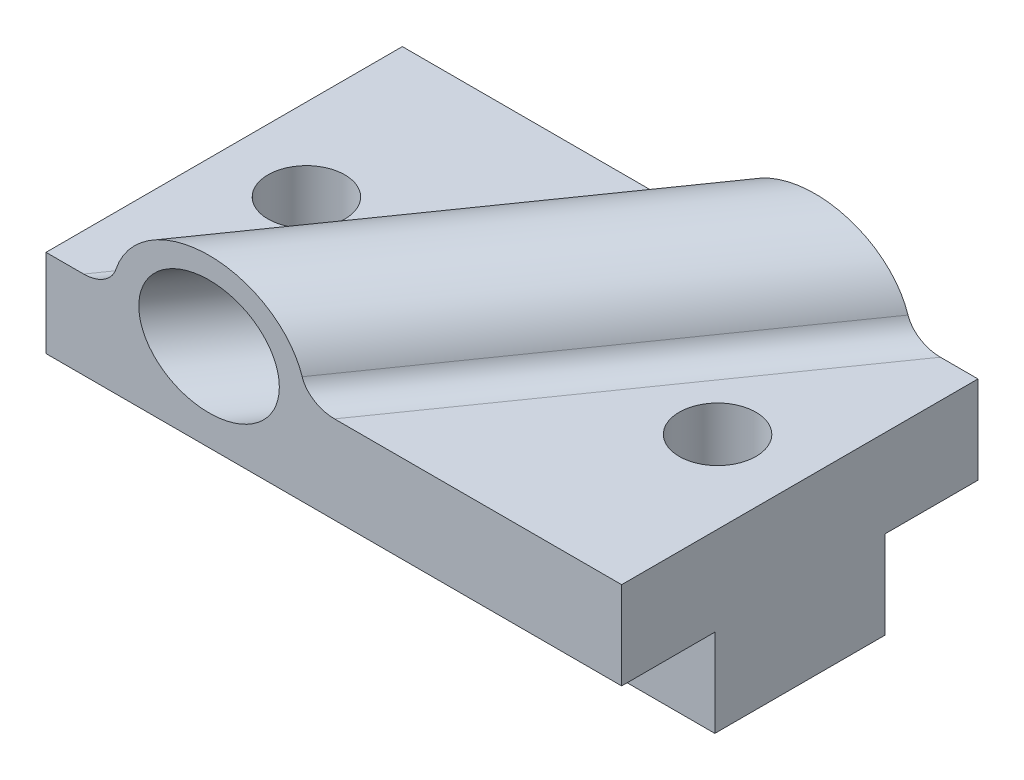
ISO-10303-21;
HEADER;
FILE_DESCRIPTION(('STEP AP214'),'2;1');
FILE_NAME('part.step','',(''),(''),'','','');
FILE_SCHEMA(('AUTOMOTIVE_DESIGN { 1 0 10303 214 1 1 1 1 }'));
ENDSEC;
DATA;
#1=APPLICATION_CONTEXT('core data for automotive mechanical design processes');
#2=APPLICATION_PROTOCOL_DEFINITION('international standard','automotive_design',2000,#1);
#3=PRODUCT_CONTEXT('',#1,'mechanical');
#4=PRODUCT('Part','Part','',(#3));
#5=PRODUCT_RELATED_PRODUCT_CATEGORY('part','',(#4));
#6=PRODUCT_DEFINITION_FORMATION('','',#4);
#7=PRODUCT_DEFINITION_CONTEXT('part definition',#1,'design');
#8=PRODUCT_DEFINITION('design','',#6,#7);
#9=PRODUCT_DEFINITION_SHAPE('','',#8);
#10=(LENGTH_UNIT() NAMED_UNIT(*) SI_UNIT(.MILLI.,.METRE.));
#11=(NAMED_UNIT(*) PLANE_ANGLE_UNIT() SI_UNIT($,.RADIAN.));
#12=(NAMED_UNIT(*) SI_UNIT($,.STERADIAN.) SOLID_ANGLE_UNIT());
#13=UNCERTAINTY_MEASURE_WITH_UNIT(LENGTH_MEASURE(1.E-05),#10,'distance_accuracy_value','');
#14=(GEOMETRIC_REPRESENTATION_CONTEXT(3) GLOBAL_UNCERTAINTY_ASSIGNED_CONTEXT((#13)) GLOBAL_UNIT_ASSIGNED_CONTEXT((#10,
#11,#12)) REPRESENTATION_CONTEXT('',''));
#15=CARTESIAN_POINT('',(0.,0.,0.));
#16=DIRECTION('',(0.,0.,1.));
#17=DIRECTION('',(1.,0.,0.));
#18=AXIS2_PLACEMENT_3D('',#15,#16,#17);
#19=CARTESIAN_POINT('',(52.5,0.,32.5));
#20=DIRECTION('',(0.,-1.,0.));
#21=DIRECTION('',(0.,0.,-1.));
#22=AXIS2_PLACEMENT_3D('',#19,#20,#21);
#23=PLANE('',#22);
#24=CARTESIAN_POINT('',(37.5,0.,0.));
#25=DIRECTION('',(0.,1.,0.));
#26=DIRECTION('',(0.,0.,1.));
#27=AXIS2_PLACEMENT_3D('',#24,#25,#26);
#28=CIRCLE('',#27,7.);
#29=CARTESIAN_POINT('',(37.5,0.,7.));
#30=VERTEX_POINT('',#29);
#31=EDGE_CURVE('E168',#30,#30,#28,.T.);
#32=ORIENTED_EDGE('',*,*,#31,.F.);
#33=EDGE_LOOP('',(#32));
#34=FACE_BOUND('',#33,.T.);
#35=DIRECTION('',(-1.,0.,0.));
#36=VECTOR('',#35,1.);
#37=CARTESIAN_POINT('',(52.5,0.,-32.5));
#38=LINE('',#37,#36);
#39=CARTESIAN_POINT('',(52.5,0.,-32.5));
#40=VERTEX_POINT('',#39);
#41=CARTESIAN_POINT('',(45.6368678139135,0.,-32.5));
#42=VERTEX_POINT('',#41);
#43=EDGE_CURVE('E132',#40,#42,#38,.T.);
#44=ORIENTED_EDGE('',*,*,#43,.T.);
#45=DIRECTION('',(-0.573576436351047,0.,0.819152044288991));
#46=VECTOR('',#45,1.);
#47=CARTESIAN_POINT('',(-1.6214799556533,0.,34.9919151690324));
#48=LINE('',#47,#46);
#49=CARTESIAN_POINT('',(0.123377830282309,0.,32.5));
#50=VERTEX_POINT('',#49);
#51=EDGE_CURVE('E59',#42,#50,#48,.T.);
#52=ORIENTED_EDGE('',*,*,#51,.T.);
#53=DIRECTION('',(-1.,0.,0.));
#54=VECTOR('',#53,1.);
#55=CARTESIAN_POINT('',(52.5,0.,32.5));
#56=LINE('',#55,#54);
#57=CARTESIAN_POINT('',(52.5,0.,32.5));
#58=VERTEX_POINT('',#57);
#59=EDGE_CURVE('E133',#58,#50,#56,.T.);
#60=ORIENTED_EDGE('',*,*,#59,.F.);
#61=DIRECTION('',(0.,0.,1.));
#62=VECTOR('',#61,1.);
#63=CARTESIAN_POINT('',(52.5,0.,32.5));
#64=LINE('',#63,#62);
#65=EDGE_CURVE('E130',#40,#58,#64,.T.);
#66=ORIENTED_EDGE('',*,*,#65,.F.);
#67=EDGE_LOOP('',(#44,#52,#60,#66));
#68=FACE_BOUND('',#67,.T.);
#69=ADVANCED_FACE('F43',(#34,#68),#23,.F.);
#70=CARTESIAN_POINT('',(-37.5,0.,0.));
#71=DIRECTION('',(0.,1.,0.));
#72=DIRECTION('',(0.,0.,1.));
#73=AXIS2_PLACEMENT_3D('',#70,#71,#72);
#74=CIRCLE('',#73,7.);
#75=CARTESIAN_POINT('',(-37.5,0.,7.));
#76=VERTEX_POINT('',#75);
#77=EDGE_CURVE('E284',#76,#76,#74,.T.);
#78=ORIENTED_EDGE('',*,*,#77,.F.);
#79=EDGE_LOOP('',(#78));
#80=FACE_BOUND('',#79,.T.);
#81=CARTESIAN_POINT('',(-45.6368678139136,0.,32.5));
#82=VERTEX_POINT('',#81);
#83=CARTESIAN_POINT('',(-52.5,0.,32.5));
#84=VERTEX_POINT('',#83);
#85=EDGE_CURVE('E211',#82,#84,#56,.T.);
#86=ORIENTED_EDGE('',*,*,#85,.F.);
#87=DIRECTION('',(-0.573576436351047,0.,0.819152044288991));
#88=VECTOR('',#87,1.);
#89=CARTESIAN_POINT('',(1.6214799556533,0.,-34.9919151690324));
#90=LINE('',#89,#88);
#91=CARTESIAN_POINT('',(-0.123377830282323,0.,-32.5));
#92=VERTEX_POINT('',#91);
#93=EDGE_CURVE('E181',#82,#92,#90,.F.);
#94=ORIENTED_EDGE('',*,*,#93,.T.);
#95=CARTESIAN_POINT('',(-52.5,0.,-32.5));
#96=VERTEX_POINT('',#95);
#97=EDGE_CURVE('E153',#92,#96,#38,.T.);
#98=ORIENTED_EDGE('',*,*,#97,.T.);
#99=DIRECTION('',(0.,0.,1.));
#100=VECTOR('',#99,1.);
#101=CARTESIAN_POINT('',(-52.5,0.,32.5));
#102=LINE('',#101,#100);
#103=EDGE_CURVE('E216',#96,#84,#102,.T.);
#104=ORIENTED_EDGE('',*,*,#103,.T.);
#105=EDGE_LOOP('',(#86,#94,#98,#104));
#106=FACE_BOUND('',#105,.T.);
#107=ADVANCED_FACE('F214',(#80,#106),#23,.F.);
#108=CARTESIAN_POINT('',(52.5,0.,-32.5));
#109=DIRECTION('',(0.,0.,1.));
#110=DIRECTION('',(1.,0.,0.));
#111=AXIS2_PLACEMENT_3D('',#108,#109,#110);
#112=PLANE('',#111);
#113=CARTESIAN_POINT('',(22.7567449918156,0.,-32.5));
#114=DIRECTION('',(0.,0.,1.));
#115=DIRECTION('',(1.,0.,0.));
#116=AXIS2_PLACEMENT_3D('',#113,#114,#115);
#117=ELLIPSE('',#116,12.8181331819953,10.5);
#118=CARTESIAN_POINT('',(35.5748781738109,0.,-32.5));
#119=VERTEX_POINT('',#118);
#120=EDGE_CURVE('E176',#119,#119,#117,.F.);
#121=ORIENTED_EDGE('',*,*,#120,.F.);
#122=EDGE_LOOP('',(#121));
#123=FACE_BOUND('',#122,.T.);
#124=ORIENTED_EDGE('',*,*,#97,.F.);
#125=CARTESIAN_POINT('',(-0.123377830282323,5.,-32.5));
#126=DIRECTION('',(0.,0.,1.));
#127=DIRECTION('',(1.,0.,0.));
#128=AXIS2_PLACEMENT_3D('',#125,#126,#127);
#129=ELLIPSE('',#128,6.10387294380729,5.);
#130=CARTESIAN_POINT('',(5.77423657150578,3.71119258239032,-32.5));
#131=VERTEX_POINT('',#130);
#132=EDGE_CURVE('E189',#92,#131,#129,.T.);
#133=ORIENTED_EDGE('',*,*,#132,.T.);
#134=CARTESIAN_POINT('',(22.7567449918156,0.,-32.5));
#135=DIRECTION('',(0.,0.,1.));
#136=DIRECTION('',(-1.,0.,0.));
#137=AXIS2_PLACEMENT_3D('',#134,#135,#136);
#138=ELLIPSE('',#137,17.5764413545383,14.3977778668956);
#139=CARTESIAN_POINT('',(39.7392534121255,3.71119258239031,-32.5));
#140=VERTEX_POINT('',#139);
#141=EDGE_CURVE('E194',#131,#140,#138,.F.);
#142=ORIENTED_EDGE('',*,*,#141,.T.);
#143=CARTESIAN_POINT('',(45.6368678139136,5.,-32.5));
#144=DIRECTION('',(0.,0.,1.));
#145=DIRECTION('',(1.,0.,0.));
#146=AXIS2_PLACEMENT_3D('',#143,#144,#145);
#147=ELLIPSE('',#146,6.10387294380729,5.);
#148=EDGE_CURVE('E52',#140,#42,#147,.T.);
#149=ORIENTED_EDGE('',*,*,#148,.T.);
#150=ORIENTED_EDGE('',*,*,#43,.F.);
#151=DIRECTION('',(0.,1.,0.));
#152=VECTOR('',#151,1.);
#153=CARTESIAN_POINT('',(52.5,0.,-32.5));
#154=LINE('',#153,#152);
#155=CARTESIAN_POINT('',(52.5,-16.,-32.5));
#156=VERTEX_POINT('',#155);
#157=EDGE_CURVE('E138',#156,#40,#154,.T.);
#158=ORIENTED_EDGE('',*,*,#157,.F.);
#159=DIRECTION('',(-1.,0.,0.));
#160=VECTOR('',#159,1.);
#161=CARTESIAN_POINT('',(52.5,-16.,-32.5));
#162=LINE('',#161,#160);
#163=CARTESIAN_POINT('',(-52.5,-16.,-32.5));
#164=VERTEX_POINT('',#163);
#165=EDGE_CURVE('E244',#156,#164,#162,.T.);
#166=ORIENTED_EDGE('',*,*,#165,.T.);
#167=DIRECTION('',(0.,1.,0.));
#168=VECTOR('',#167,1.);
#169=CARTESIAN_POINT('',(-52.5,0.,-32.5));
#170=LINE('',#169,#168);
#171=EDGE_CURVE('E172',#164,#96,#170,.T.);
#172=ORIENTED_EDGE('',*,*,#171,.T.);
#173=EDGE_LOOP('',(#124,#133,#142,#149,#150,#158,#166,#172));
#174=FACE_BOUND('',#173,.T.);
#175=ADVANCED_FACE('F150',(#123,#174),#112,.F.);
#176=CARTESIAN_POINT('',(52.5,-16.,32.5));
#177=DIRECTION('',(0.,0.,-1.));
#178=DIRECTION('',(-1.,0.,0.));
#179=AXIS2_PLACEMENT_3D('',#176,#177,#178);
#180=PLANE('',#179);
#181=CARTESIAN_POINT('',(-22.7567449918156,0.,32.5));
#182=DIRECTION('',(0.,0.,-1.));
#183=DIRECTION('',(1.,0.,0.));
#184=AXIS2_PLACEMENT_3D('',#181,#182,#183);
#185=ELLIPSE('',#184,12.8181331819953,10.5);
#186=CARTESIAN_POINT('',(-9.93861180982033,0.,32.5));
#187=VERTEX_POINT('',#186);
#188=EDGE_CURVE('E173',#187,#187,#185,.F.);
#189=ORIENTED_EDGE('',*,*,#188,.F.);
#190=EDGE_LOOP('',(#189));
#191=FACE_BOUND('',#190,.T.);
#192=ORIENTED_EDGE('',*,*,#59,.T.);
#193=CARTESIAN_POINT('',(0.123377830282309,5.,32.5));
#194=DIRECTION('',(0.,0.,-1.));
#195=DIRECTION('',(1.,0.,0.));
#196=AXIS2_PLACEMENT_3D('',#193,#194,#195);
#197=ELLIPSE('',#196,6.10387294380729,5.);
#198=CARTESIAN_POINT('',(-5.77423657150578,3.71119258239032,32.5));
#199=VERTEX_POINT('',#198);
#200=EDGE_CURVE('E11',#50,#199,#197,.T.);
#201=ORIENTED_EDGE('',*,*,#200,.T.);
#202=CARTESIAN_POINT('',(-22.7567449918156,0.,32.5));
#203=DIRECTION('',(0.,0.,-1.));
#204=DIRECTION('',(1.,0.,0.));
#205=AXIS2_PLACEMENT_3D('',#202,#203,#204);
#206=ELLIPSE('',#205,17.5764413545383,14.3977778668956);
#207=CARTESIAN_POINT('',(-39.7392534121255,3.71119258239031,32.5));
#208=VERTEX_POINT('',#207);
#209=EDGE_CURVE('E205',#208,#199,#206,.T.);
#210=ORIENTED_EDGE('',*,*,#209,.F.);
#211=CARTESIAN_POINT('',(-45.6368678139136,5.,32.5));
#212=DIRECTION('',(0.,0.,-1.));
#213=DIRECTION('',(1.,0.,0.));
#214=AXIS2_PLACEMENT_3D('',#211,#212,#213);
#215=ELLIPSE('',#214,6.10387294380729,5.);
#216=EDGE_CURVE('E186',#208,#82,#215,.T.);
#217=ORIENTED_EDGE('',*,*,#216,.T.);
#218=ORIENTED_EDGE('',*,*,#85,.T.);
#219=DIRECTION('',(0.,-1.,0.));
#220=VECTOR('',#219,1.);
#221=CARTESIAN_POINT('',(-52.5,-16.,32.5));
#222=LINE('',#221,#220);
#223=CARTESIAN_POINT('',(-52.5,-16.,32.5));
#224=VERTEX_POINT('',#223);
#225=EDGE_CURVE('E261',#84,#224,#222,.T.);
#226=ORIENTED_EDGE('',*,*,#225,.T.);
#227=DIRECTION('',(-1.,0.,0.));
#228=VECTOR('',#227,1.);
#229=CARTESIAN_POINT('',(52.5,-16.,32.5));
#230=LINE('',#229,#228);
#231=CARTESIAN_POINT('',(52.5,-16.,32.5));
#232=VERTEX_POINT('',#231);
#233=EDGE_CURVE('E219',#232,#224,#230,.T.);
#234=ORIENTED_EDGE('',*,*,#233,.F.);
#235=DIRECTION('',(0.,-1.,0.));
#236=VECTOR('',#235,1.);
#237=CARTESIAN_POINT('',(52.5,-16.,32.5));
#238=LINE('',#237,#236);
#239=EDGE_CURVE('E137',#58,#232,#238,.T.);
#240=ORIENTED_EDGE('',*,*,#239,.F.);
#241=EDGE_LOOP('',(#192,#201,#210,#217,#218,#226,#234,#240));
#242=FACE_BOUND('',#241,.T.);
#243=ADVANCED_FACE('F210',(#191,#242),#180,.F.);
#244=CARTESIAN_POINT('',(52.5,-16.,15.5));
#245=DIRECTION('',(0.,1.,0.));
#246=DIRECTION('',(0.,0.,1.));
#247=AXIS2_PLACEMENT_3D('',#244,#245,#246);
#248=PLANE('',#247);
#249=DIRECTION('',(0.,0.,-1.));
#250=VECTOR('',#249,1.);
#251=CARTESIAN_POINT('',(-52.5,-16.,15.5));
#252=LINE('',#251,#250);
#253=CARTESIAN_POINT('',(-52.5,-16.,15.5));
#254=VERTEX_POINT('',#253);
#255=EDGE_CURVE('E258',#224,#254,#252,.T.);
#256=ORIENTED_EDGE('',*,*,#255,.T.);
#257=DIRECTION('',(-1.,0.,0.));
#258=VECTOR('',#257,1.);
#259=CARTESIAN_POINT('',(52.5,-16.,15.5));
#260=LINE('',#259,#258);
#261=CARTESIAN_POINT('',(52.5,-16.,15.5));
#262=VERTEX_POINT('',#261);
#263=EDGE_CURVE('E223',#262,#254,#260,.T.);
#264=ORIENTED_EDGE('',*,*,#263,.F.);
#265=DIRECTION('',(0.,0.,-1.));
#266=VECTOR('',#265,1.);
#267=CARTESIAN_POINT('',(52.5,-16.,15.5));
#268=LINE('',#267,#266);
#269=EDGE_CURVE('E279',#232,#262,#268,.T.);
#270=ORIENTED_EDGE('',*,*,#269,.F.);
#271=ORIENTED_EDGE('',*,*,#233,.T.);
#272=EDGE_LOOP('',(#256,#264,#270,#271));
#273=FACE_BOUND('',#272,.T.);
#274=ADVANCED_FACE('F305',(#273),#248,.F.);
#275=CARTESIAN_POINT('',(52.5,-32.,15.5));
#276=DIRECTION('',(0.,0.,-1.));
#277=DIRECTION('',(-1.,0.,0.));
#278=AXIS2_PLACEMENT_3D('',#275,#276,#277);
#279=PLANE('',#278);
#280=DIRECTION('',(0.,-1.,0.));
#281=VECTOR('',#280,1.);
#282=CARTESIAN_POINT('',(-52.5,-32.,15.5));
#283=LINE('',#282,#281);
#284=CARTESIAN_POINT('',(-52.5,-32.,15.5));
#285=VERTEX_POINT('',#284);
#286=EDGE_CURVE('E255',#254,#285,#283,.T.);
#287=ORIENTED_EDGE('',*,*,#286,.T.);
#288=DIRECTION('',(-1.,0.,0.));
#289=VECTOR('',#288,1.);
#290=CARTESIAN_POINT('',(52.5,-32.,15.5));
#291=LINE('',#290,#289);
#292=CARTESIAN_POINT('',(52.5,-32.,15.5));
#293=VERTEX_POINT('',#292);
#294=EDGE_CURVE('E230',#293,#285,#291,.T.);
#295=ORIENTED_EDGE('',*,*,#294,.F.);
#296=DIRECTION('',(0.,-1.,0.));
#297=VECTOR('',#296,1.);
#298=CARTESIAN_POINT('',(52.5,-32.,15.5));
#299=LINE('',#298,#297);
#300=EDGE_CURVE('E276',#262,#293,#299,.T.);
#301=ORIENTED_EDGE('',*,*,#300,.F.);
#302=ORIENTED_EDGE('',*,*,#263,.T.);
#303=EDGE_LOOP('',(#287,#295,#301,#302));
#304=FACE_BOUND('',#303,.T.);
#305=ADVANCED_FACE('F319',(#304),#279,.F.);
#306=CARTESIAN_POINT('',(52.5,-32.,-15.5));
#307=DIRECTION('',(0.,1.,0.));
#308=DIRECTION('',(0.,0.,1.));
#309=AXIS2_PLACEMENT_3D('',#306,#307,#308);
#310=PLANE('',#309);
#311=CARTESIAN_POINT('',(37.5,-32.,0.));
#312=DIRECTION('',(0.,1.,0.));
#313=DIRECTION('',(0.,0.,1.));
#314=AXIS2_PLACEMENT_3D('',#311,#312,#313);
#315=CIRCLE('',#314,7.);
#316=CARTESIAN_POINT('',(37.5,-32.,7.));
#317=VERTEX_POINT('',#316);
#318=EDGE_CURVE('E167',#317,#317,#315,.T.);
#319=ORIENTED_EDGE('',*,*,#318,.T.);
#320=EDGE_LOOP('',(#319));
#321=FACE_BOUND('',#320,.T.);
#322=CARTESIAN_POINT('',(-37.5,-32.,0.));
#323=DIRECTION('',(0.,1.,0.));
#324=DIRECTION('',(0.,0.,1.));
#325=AXIS2_PLACEMENT_3D('',#322,#323,#324);
#326=CIRCLE('',#325,7.);
#327=CARTESIAN_POINT('',(-37.5,-32.,7.));
#328=VERTEX_POINT('',#327);
#329=EDGE_CURVE('E163',#328,#328,#326,.T.);
#330=ORIENTED_EDGE('',*,*,#329,.T.);
#331=EDGE_LOOP('',(#330));
#332=FACE_BOUND('',#331,.T.);
#333=DIRECTION('',(0.,0.,-1.));
#334=VECTOR('',#333,1.);
#335=CARTESIAN_POINT('',(-52.5,-32.,-15.5));
#336=LINE('',#335,#334);
#337=CARTESIAN_POINT('',(-52.5,-32.,-15.5));
#338=VERTEX_POINT('',#337);
#339=EDGE_CURVE('E252',#285,#338,#336,.T.);
#340=ORIENTED_EDGE('',*,*,#339,.T.);
#341=DIRECTION('',(-1.,0.,0.));
#342=VECTOR('',#341,1.);
#343=CARTESIAN_POINT('',(52.5,-32.,-15.5));
#344=LINE('',#343,#342);
#345=CARTESIAN_POINT('',(52.5,-32.,-15.5));
#346=VERTEX_POINT('',#345);
#347=EDGE_CURVE('E236',#346,#338,#344,.T.);
#348=ORIENTED_EDGE('',*,*,#347,.F.);
#349=DIRECTION('',(0.,0.,-1.));
#350=VECTOR('',#349,1.);
#351=CARTESIAN_POINT('',(52.5,-32.,-15.5));
#352=LINE('',#351,#350);
#353=EDGE_CURVE('E273',#293,#346,#352,.T.);
#354=ORIENTED_EDGE('',*,*,#353,.F.);
#355=ORIENTED_EDGE('',*,*,#294,.T.);
#356=EDGE_LOOP('',(#340,#348,#354,#355));
#357=FACE_BOUND('',#356,.T.);
#358=ADVANCED_FACE('F322',(#321,#332,#357),#310,.F.);
#359=CARTESIAN_POINT('',(52.5,-16.,-15.5));
#360=DIRECTION('',(0.,0.,1.));
#361=DIRECTION('',(0.,-1.,0.));
#362=AXIS2_PLACEMENT_3D('',#359,#360,#361);
#363=PLANE('',#362);
#364=DIRECTION('',(0.,1.,0.));
#365=VECTOR('',#364,1.);
#366=CARTESIAN_POINT('',(-52.5,-16.,-15.5));
#367=LINE('',#366,#365);
#368=CARTESIAN_POINT('',(-52.5,-16.,-15.5));
#369=VERTEX_POINT('',#368);
#370=EDGE_CURVE('E249',#338,#369,#367,.T.);
#371=ORIENTED_EDGE('',*,*,#370,.T.);
#372=DIRECTION('',(-1.,0.,0.));
#373=VECTOR('',#372,1.);
#374=CARTESIAN_POINT('',(52.5,-16.,-15.5));
#375=LINE('',#374,#373);
#376=CARTESIAN_POINT('',(52.5,-16.,-15.5));
#377=VERTEX_POINT('',#376);
#378=EDGE_CURVE('E240',#377,#369,#375,.T.);
#379=ORIENTED_EDGE('',*,*,#378,.F.);
#380=DIRECTION('',(0.,1.,0.));
#381=VECTOR('',#380,1.);
#382=CARTESIAN_POINT('',(52.5,-16.,-15.5));
#383=LINE('',#382,#381);
#384=EDGE_CURVE('E270',#346,#377,#383,.T.);
#385=ORIENTED_EDGE('',*,*,#384,.F.);
#386=ORIENTED_EDGE('',*,*,#347,.T.);
#387=EDGE_LOOP('',(#371,#379,#385,#386));
#388=FACE_BOUND('',#387,.T.);
#389=ADVANCED_FACE('F326',(#388),#363,.F.);
#390=CARTESIAN_POINT('',(52.5,-16.,-32.5));
#391=DIRECTION('',(0.,1.,0.));
#392=DIRECTION('',(0.,0.,1.));
#393=AXIS2_PLACEMENT_3D('',#390,#391,#392);
#394=PLANE('',#393);
#395=DIRECTION('',(0.,0.,-1.));
#396=VECTOR('',#395,1.);
#397=CARTESIAN_POINT('',(-52.5,-16.,-32.5));
#398=LINE('',#397,#396);
#399=EDGE_CURVE('E147',#369,#164,#398,.T.);
#400=ORIENTED_EDGE('',*,*,#399,.T.);
#401=ORIENTED_EDGE('',*,*,#165,.F.);
#402=DIRECTION('',(0.,0.,-1.));
#403=VECTOR('',#402,1.);
#404=CARTESIAN_POINT('',(52.5,-16.,-32.5));
#405=LINE('',#404,#403);
#406=EDGE_CURVE('E143',#377,#156,#405,.T.);
#407=ORIENTED_EDGE('',*,*,#406,.F.);
#408=ORIENTED_EDGE('',*,*,#378,.T.);
#409=EDGE_LOOP('',(#400,#401,#407,#408));
#410=FACE_BOUND('',#409,.T.);
#411=ADVANCED_FACE('F330',(#410),#394,.F.);
#412=CARTESIAN_POINT('',(52.5,0.,0.));
#413=DIRECTION('',(-1.,0.,0.));
#414=DIRECTION('',(0.,0.,1.));
#415=AXIS2_PLACEMENT_3D('',#412,#413,#414);
#416=PLANE('',#415);
#417=ORIENTED_EDGE('',*,*,#157,.T.);
#418=ORIENTED_EDGE('',*,*,#65,.T.);
#419=ORIENTED_EDGE('',*,*,#239,.T.);
#420=ORIENTED_EDGE('',*,*,#269,.T.);
#421=ORIENTED_EDGE('',*,*,#300,.T.);
#422=ORIENTED_EDGE('',*,*,#353,.T.);
#423=ORIENTED_EDGE('',*,*,#384,.T.);
#424=ORIENTED_EDGE('',*,*,#406,.T.);
#425=EDGE_LOOP('',(#417,#418,#419,#420,#421,#422,#423,#424));
#426=FACE_BOUND('',#425,.T.);
#427=ADVANCED_FACE('F141',(#426),#416,.F.);
#428=CARTESIAN_POINT('',(-52.5,0.,0.));
#429=DIRECTION('',(-1.,0.,0.));
#430=DIRECTION('',(0.,0.,1.));
#431=AXIS2_PLACEMENT_3D('',#428,#429,#430);
#432=PLANE('',#431);
#433=ORIENTED_EDGE('',*,*,#171,.F.);
#434=ORIENTED_EDGE('',*,*,#399,.F.);
#435=ORIENTED_EDGE('',*,*,#370,.F.);
#436=ORIENTED_EDGE('',*,*,#339,.F.);
#437=ORIENTED_EDGE('',*,*,#286,.F.);
#438=ORIENTED_EDGE('',*,*,#255,.F.);
#439=ORIENTED_EDGE('',*,*,#225,.F.);
#440=ORIENTED_EDGE('',*,*,#103,.F.);
#441=EDGE_LOOP('',(#433,#434,#435,#436,#437,#438,#439,#440));
#442=FACE_BOUND('',#441,.T.);
#443=ADVANCED_FACE('F335',(#442),#432,.T.);
#444=CARTESIAN_POINT('',(-37.5,-105.,0.));
#445=DIRECTION('',(0.,1.,0.));
#446=DIRECTION('',(0.,0.,1.));
#447=AXIS2_PLACEMENT_3D('',#444,#445,#446);
#448=CYLINDRICAL_SURFACE('',#447,7.);
#449=ORIENTED_EDGE('',*,*,#77,.T.);
#450=EDGE_LOOP('',(#449));
#451=FACE_BOUND('',#450,.T.);
#452=ORIENTED_EDGE('',*,*,#329,.F.);
#453=EDGE_LOOP('',(#452));
#454=FACE_BOUND('',#453,.T.);
#455=ADVANCED_FACE('F338',(#451,#454),#448,.F.);
#456=CARTESIAN_POINT('',(37.5,-105.,0.));
#457=DIRECTION('',(0.,1.,0.));
#458=DIRECTION('',(0.,0.,1.));
#459=AXIS2_PLACEMENT_3D('',#456,#457,#458);
#460=CYLINDRICAL_SURFACE('',#459,7.);
#461=ORIENTED_EDGE('',*,*,#31,.T.);
#462=EDGE_LOOP('',(#461));
#463=FACE_BOUND('',#462,.T.);
#464=ORIENTED_EDGE('',*,*,#318,.F.);
#465=EDGE_LOOP('',(#464));
#466=FACE_BOUND('',#465,.T.);
#467=ADVANCED_FACE('F344',(#463,#466),#460,.F.);
#468=CARTESIAN_POINT('',(-48.6929390774708,0.,69.540723885905));
#469=DIRECTION('',(0.573576436351047,0.,-0.819152044288991));
#470=DIRECTION('',(-0.819152044288991,0.,-0.573576436351047));
#471=AXIS2_PLACEMENT_3D('',#468,#469,#470);
#472=CYLINDRICAL_SURFACE('',#471,14.3977778668956);
#473=ORIENTED_EDGE('',*,*,#141,.F.);
#474=DIRECTION('',(0.573576436351047,0.,-0.819152044288991));
#475=VECTOR('',#474,1.);
#476=CARTESIAN_POINT('',(-60.0883732695976,3.71119258239032,61.5615549634051));
#477=LINE('',#476,#475);
#478=EDGE_CURVE('E158',#131,#208,#477,.F.);
#479=ORIENTED_EDGE('',*,*,#478,.T.);
#480=ORIENTED_EDGE('',*,*,#209,.T.);
#481=DIRECTION('',(0.573576436351047,0.,-0.819152044288991));
#482=VECTOR('',#481,1.);
#483=CARTESIAN_POINT('',(-37.297504885344,3.71119258239032,77.5198928084048));
#484=LINE('',#483,#482);
#485=EDGE_CURVE('E152',#199,#140,#484,.T.);
#486=ORIENTED_EDGE('',*,*,#485,.T.);
#487=EDGE_LOOP('',(#473,#479,#480,#486));
#488=FACE_BOUND('',#487,.T.);
#489=ADVANCED_FACE('F200',(#488),#472,.T.);
#490=CARTESIAN_POINT('',(-43.0182327263285,0.,61.4364033216744));
#491=DIRECTION('',(0.573576436351047,0.,-0.819152044288991));
#492=DIRECTION('',(-0.819152044288991,0.,-0.573576436351047));
#493=AXIS2_PLACEMENT_3D('',#490,#491,#492);
#494=CYLINDRICAL_SURFACE('',#493,10.5);
#495=ORIENTED_EDGE('',*,*,#188,.T.);
#496=EDGE_LOOP('',(#495));
#497=FACE_BOUND('',#496,.T.);
#498=ORIENTED_EDGE('',*,*,#120,.T.);
#499=EDGE_LOOP('',(#498));
#500=FACE_BOUND('',#499,.T.);
#501=ADVANCED_FACE('F297',(#497,#500),#494,.F.);
#502=CARTESIAN_POINT('',(-64.0457319319812,5.,58.7905825966046));
#503=DIRECTION('',(0.573576436351047,0.,-0.819152044288991));
#504=DIRECTION('',(-0.819152044288991,0.,-0.573576436351047));
#505=AXIS2_PLACEMENT_3D('',#502,#503,#504);
#506=CYLINDRICAL_SURFACE('',#505,5.);
#507=ORIENTED_EDGE('',*,*,#132,.F.);
#508=ORIENTED_EDGE('',*,*,#93,.F.);
#509=ORIENTED_EDGE('',*,*,#216,.F.);
#510=ORIENTED_EDGE('',*,*,#478,.F.);
#511=EDGE_LOOP('',(#507,#508,#509,#510));
#512=FACE_BOUND('',#511,.T.);
#513=ADVANCED_FACE('F207',(#512),#506,.F.);
#514=CARTESIAN_POINT('',(-33.3401462229604,5.,80.2908651752053));
#515=DIRECTION('',(0.573576436351047,0.,-0.819152044288991));
#516=DIRECTION('',(-0.819152044288991,0.,-0.573576436351047));
#517=AXIS2_PLACEMENT_3D('',#514,#515,#516);
#518=CYLINDRICAL_SURFACE('',#517,5.);
#519=ORIENTED_EDGE('',*,*,#200,.F.);
#520=ORIENTED_EDGE('',*,*,#51,.F.);
#521=ORIENTED_EDGE('',*,*,#148,.F.);
#522=ORIENTED_EDGE('',*,*,#485,.F.);
#523=EDGE_LOOP('',(#519,#520,#521,#522));
#524=FACE_BOUND('',#523,.T.);
#525=ADVANCED_FACE('F45',(#524),#518,.F.);
#526=CLOSED_SHELL('',(#69,#107,#175,#243,#274,#305,#358,#389,#411,#427,#443,#455,#467,#489,#501,
#513,#525));
#527=MANIFOLD_SOLID_BREP('B2',#526);
#528=ADVANCED_BREP_SHAPE_REPRESENTATION('',(#18,#527),#14);
#529=SHAPE_DEFINITION_REPRESENTATION(#9,#528);
ENDSEC;
END-ISO-10303-21;
